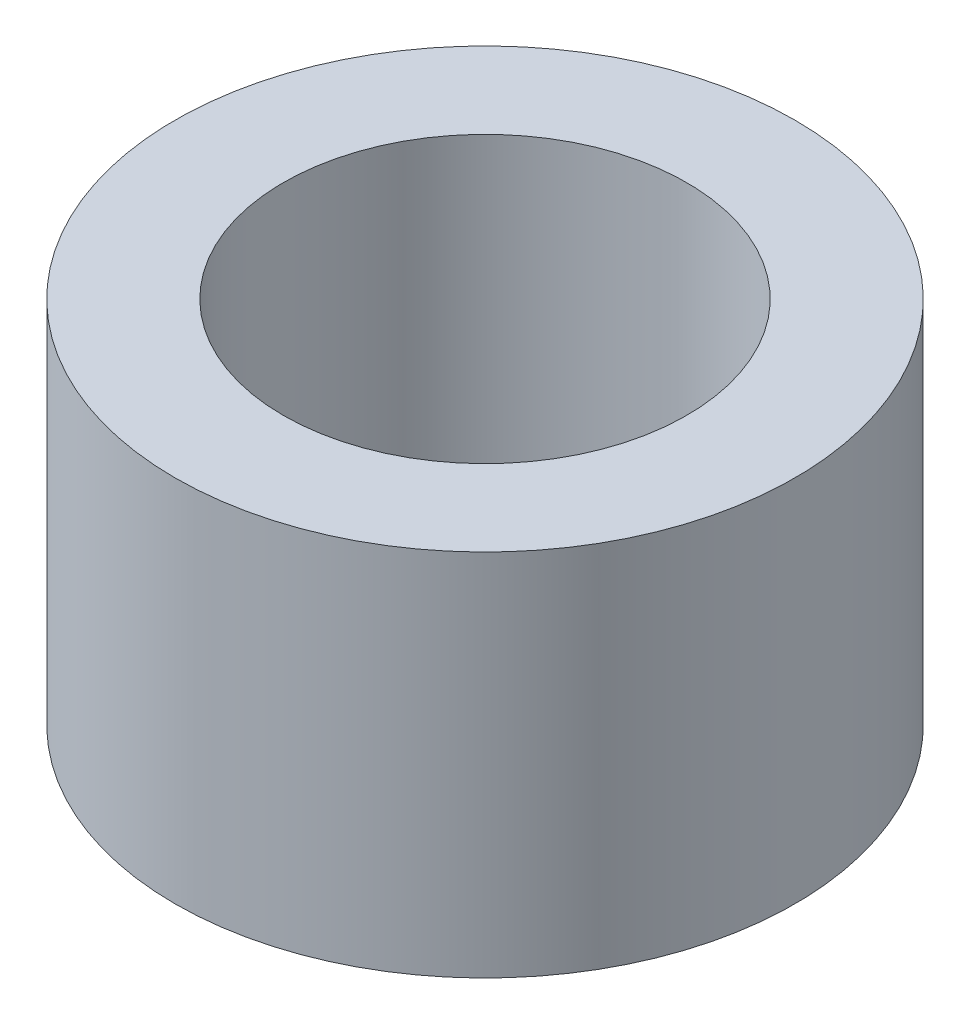
ISO-10303-21;
HEADER;
FILE_DESCRIPTION(('STEP AP214'),'2;1');
FILE_NAME('part.step','',(''),(''),'','','');
FILE_SCHEMA(('AUTOMOTIVE_DESIGN { 1 0 10303 214 1 1 1 1 }'));
ENDSEC;
DATA;
#1=APPLICATION_CONTEXT('core data for automotive mechanical design processes');
#2=APPLICATION_PROTOCOL_DEFINITION('international standard','automotive_design',2000,#1);
#3=PRODUCT_CONTEXT('',#1,'mechanical');
#4=PRODUCT('Part','Part','',(#3));
#5=PRODUCT_RELATED_PRODUCT_CATEGORY('part','',(#4));
#6=PRODUCT_DEFINITION_FORMATION('','',#4);
#7=PRODUCT_DEFINITION_CONTEXT('part definition',#1,'design');
#8=PRODUCT_DEFINITION('design','',#6,#7);
#9=PRODUCT_DEFINITION_SHAPE('','',#8);
#10=(LENGTH_UNIT() NAMED_UNIT(*) SI_UNIT(.MILLI.,.METRE.));
#11=(NAMED_UNIT(*) PLANE_ANGLE_UNIT() SI_UNIT($,.RADIAN.));
#12=(NAMED_UNIT(*) SI_UNIT($,.STERADIAN.) SOLID_ANGLE_UNIT());
#13=UNCERTAINTY_MEASURE_WITH_UNIT(LENGTH_MEASURE(1.E-05),#10,'distance_accuracy_value','');
#14=(GEOMETRIC_REPRESENTATION_CONTEXT(3) GLOBAL_UNCERTAINTY_ASSIGNED_CONTEXT((#13)) GLOBAL_UNIT_ASSIGNED_CONTEXT((#10,
#11,#12)) REPRESENTATION_CONTEXT('',''));
#15=CARTESIAN_POINT('',(0.,0.,0.));
#16=DIRECTION('',(0.,0.,1.));
#17=DIRECTION('',(1.,0.,0.));
#18=AXIS2_PLACEMENT_3D('',#15,#16,#17);
#19=CARTESIAN_POINT('',(0.,7.5,0.));
#20=DIRECTION('',(0.,1.,0.));
#21=DIRECTION('',(0.,0.,1.));
#22=AXIS2_PLACEMENT_3D('',#19,#20,#21);
#23=PLANE('',#22);
#24=CARTESIAN_POINT('',(0.,7.5,0.));
#25=DIRECTION('',(0.,1.,0.));
#26=DIRECTION('',(0.,0.,1.));
#27=AXIS2_PLACEMENT_3D('',#24,#25,#26);
#28=CIRCLE('',#27,6.3);
#29=CARTESIAN_POINT('',(0.,7.5,6.3));
#30=VERTEX_POINT('',#29);
#31=EDGE_CURVE('E10',#30,#30,#28,.T.);
#32=ORIENTED_EDGE('',*,*,#31,.T.);
#33=EDGE_LOOP('',(#32));
#34=FACE_BOUND('',#33,.T.);
#35=CARTESIAN_POINT('',(0.,7.5,0.));
#36=DIRECTION('',(0.,1.,0.));
#37=DIRECTION('',(0.,0.,1.));
#38=AXIS2_PLACEMENT_3D('',#35,#36,#37);
#39=CIRCLE('',#38,4.1);
#40=CARTESIAN_POINT('',(0.,7.5,4.1));
#41=VERTEX_POINT('',#40);
#42=EDGE_CURVE('E42',#41,#41,#39,.T.);
#43=ORIENTED_EDGE('',*,*,#42,.F.);
#44=EDGE_LOOP('',(#43));
#45=FACE_BOUND('',#44,.T.);
#46=ADVANCED_FACE('F31',(#34,#45),#23,.T.);
#47=CARTESIAN_POINT('',(0.,0.,0.));
#48=DIRECTION('',(0.,1.,0.));
#49=DIRECTION('',(0.,0.,1.));
#50=AXIS2_PLACEMENT_3D('',#47,#48,#49);
#51=PLANE('',#50);
#52=CARTESIAN_POINT('',(0.,0.,0.));
#53=DIRECTION('',(0.,1.,0.));
#54=DIRECTION('',(0.,0.,1.));
#55=AXIS2_PLACEMENT_3D('',#52,#53,#54);
#56=CIRCLE('',#55,6.3);
#57=CARTESIAN_POINT('',(0.,0.,6.3));
#58=VERTEX_POINT('',#57);
#59=EDGE_CURVE('E35',#58,#58,#56,.T.);
#60=ORIENTED_EDGE('',*,*,#59,.F.);
#61=EDGE_LOOP('',(#60));
#62=FACE_BOUND('',#61,.T.);
#63=CARTESIAN_POINT('',(0.,0.,0.));
#64=DIRECTION('',(0.,1.,0.));
#65=DIRECTION('',(0.,0.,1.));
#66=AXIS2_PLACEMENT_3D('',#63,#64,#65);
#67=CIRCLE('',#66,4.1);
#68=CARTESIAN_POINT('',(0.,0.,4.1));
#69=VERTEX_POINT('',#68);
#70=EDGE_CURVE('E44',#69,#69,#67,.T.);
#71=ORIENTED_EDGE('',*,*,#70,.T.);
#72=EDGE_LOOP('',(#71));
#73=FACE_BOUND('',#72,.T.);
#74=ADVANCED_FACE('F54',(#62,#73),#51,.F.);
#75=CARTESIAN_POINT('',(0.,7.5,0.));
#76=DIRECTION('',(0.,-1.,0.));
#77=DIRECTION('',(0.,0.,-1.));
#78=AXIS2_PLACEMENT_3D('',#75,#76,#77);
#79=CYLINDRICAL_SURFACE('',#78,6.3);
#80=ORIENTED_EDGE('',*,*,#31,.F.);
#81=EDGE_LOOP('',(#80));
#82=FACE_BOUND('',#81,.T.);
#83=ORIENTED_EDGE('',*,*,#59,.T.);
#84=EDGE_LOOP('',(#83));
#85=FACE_BOUND('',#84,.T.);
#86=ADVANCED_FACE('F33',(#82,#85),#79,.T.);
#87=CARTESIAN_POINT('',(0.,7.5,0.));
#88=DIRECTION('',(0.,-1.,0.));
#89=DIRECTION('',(0.,0.,-1.));
#90=AXIS2_PLACEMENT_3D('',#87,#88,#89);
#91=CYLINDRICAL_SURFACE('',#90,4.1);
#92=ORIENTED_EDGE('',*,*,#42,.T.);
#93=EDGE_LOOP('',(#92));
#94=FACE_BOUND('',#93,.T.);
#95=ORIENTED_EDGE('',*,*,#70,.F.);
#96=EDGE_LOOP('',(#95));
#97=FACE_BOUND('',#96,.T.);
#98=ADVANCED_FACE('F50',(#94,#97),#91,.F.);
#99=CLOSED_SHELL('',(#46,#74,#86,#98));
#100=MANIFOLD_SOLID_BREP('B2',#99);
#101=ADVANCED_BREP_SHAPE_REPRESENTATION('',(#18,#100),#14);
#102=SHAPE_DEFINITION_REPRESENTATION(#9,#101);
ENDSEC;
END-ISO-10303-21;
